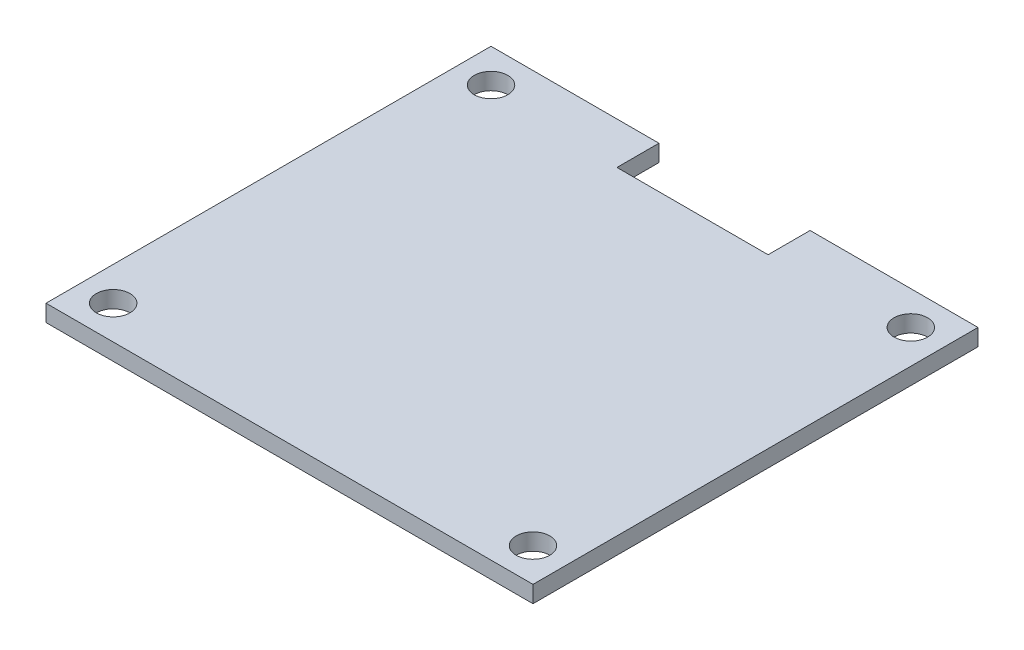
ISO-10303-21;
HEADER;
FILE_DESCRIPTION(('STEP AP214'),'2;1');
FILE_NAME('part.step','',(''),(''),'','','');
FILE_SCHEMA(('AUTOMOTIVE_DESIGN { 1 0 10303 214 1 1 1 1 }'));
ENDSEC;
DATA;
#1=APPLICATION_CONTEXT('core data for automotive mechanical design processes');
#2=APPLICATION_PROTOCOL_DEFINITION('international standard','automotive_design',2000,#1);
#3=PRODUCT_CONTEXT('',#1,'mechanical');
#4=PRODUCT('Part','Part','',(#3));
#5=PRODUCT_RELATED_PRODUCT_CATEGORY('part','',(#4));
#6=PRODUCT_DEFINITION_FORMATION('','',#4);
#7=PRODUCT_DEFINITION_CONTEXT('part definition',#1,'design');
#8=PRODUCT_DEFINITION('design','',#6,#7);
#9=PRODUCT_DEFINITION_SHAPE('','',#8);
#10=(LENGTH_UNIT() NAMED_UNIT(*) SI_UNIT(.MILLI.,.METRE.));
#11=(NAMED_UNIT(*) PLANE_ANGLE_UNIT() SI_UNIT($,.RADIAN.));
#12=(NAMED_UNIT(*) SI_UNIT($,.STERADIAN.) SOLID_ANGLE_UNIT());
#13=UNCERTAINTY_MEASURE_WITH_UNIT(LENGTH_MEASURE(1.E-05),#10,'distance_accuracy_value','');
#14=(GEOMETRIC_REPRESENTATION_CONTEXT(3) GLOBAL_UNCERTAINTY_ASSIGNED_CONTEXT((#13)) GLOBAL_UNIT_ASSIGNED_CONTEXT((#10,
#11,#12)) REPRESENTATION_CONTEXT('',''));
#15=CARTESIAN_POINT('',(0.,0.,0.));
#16=DIRECTION('',(0.,0.,1.));
#17=DIRECTION('',(1.,0.,0.));
#18=AXIS2_PLACEMENT_3D('',#15,#16,#17);
#19=CARTESIAN_POINT('',(-29.,2.,-26.5));
#20=DIRECTION('',(0.,0.,1.));
#21=DIRECTION('',(1.,0.,0.));
#22=AXIS2_PLACEMENT_3D('',#19,#20,#21);
#23=PLANE('',#22);
#24=DIRECTION('',(-1.,0.,0.));
#25=VECTOR('',#24,1.);
#26=CARTESIAN_POINT('',(-29.,2.,-26.5));
#27=LINE('',#26,#25);
#28=CARTESIAN_POINT('',(-9.,2.,-26.5));
#29=VERTEX_POINT('',#28);
#30=CARTESIAN_POINT('',(-29.,2.,-26.5));
#31=VERTEX_POINT('',#30);
#32=EDGE_CURVE('E169',#29,#31,#27,.T.);
#33=ORIENTED_EDGE('',*,*,#32,.F.);
#34=DIRECTION('',(0.,1.,0.));
#35=VECTOR('',#34,1.);
#36=CARTESIAN_POINT('',(-9.,-18.6815416922694,-26.5));
#37=LINE('',#36,#35);
#38=CARTESIAN_POINT('',(-9.,0.,-26.5));
#39=VERTEX_POINT('',#38);
#40=EDGE_CURVE('E126',#39,#29,#37,.T.);
#41=ORIENTED_EDGE('',*,*,#40,.F.);
#42=DIRECTION('',(-1.,0.,0.));
#43=VECTOR('',#42,1.);
#44=CARTESIAN_POINT('',(-29.,0.,-26.5));
#45=LINE('',#44,#43);
#46=CARTESIAN_POINT('',(-29.,0.,-26.5));
#47=VERTEX_POINT('',#46);
#48=EDGE_CURVE('E177',#39,#47,#45,.T.);
#49=ORIENTED_EDGE('',*,*,#48,.T.);
#50=DIRECTION('',(0.,-1.,0.));
#51=VECTOR('',#50,1.);
#52=CARTESIAN_POINT('',(-29.,2.,-26.5));
#53=LINE('',#52,#51);
#54=EDGE_CURVE('E45',#31,#47,#53,.T.);
#55=ORIENTED_EDGE('',*,*,#54,.F.);
#56=EDGE_LOOP('',(#33,#41,#49,#55));
#57=FACE_BOUND('',#56,.T.);
#58=ADVANCED_FACE('F37',(#57),#23,.F.);
#59=CARTESIAN_POINT('',(29.,2.,-26.5));
#60=DIRECTION('',(-1.,0.,0.));
#61=DIRECTION('',(0.,0.,1.));
#62=AXIS2_PLACEMENT_3D('',#59,#60,#61);
#63=PLANE('',#62);
#64=DIRECTION('',(0.,0.,-1.));
#65=VECTOR('',#64,1.);
#66=CARTESIAN_POINT('',(29.,0.,-26.5));
#67=LINE('',#66,#65);
#68=CARTESIAN_POINT('',(29.,0.,26.5));
#69=VERTEX_POINT('',#68);
#70=CARTESIAN_POINT('',(29.,0.,-26.5));
#71=VERTEX_POINT('',#70);
#72=EDGE_CURVE('E166',#69,#71,#67,.T.);
#73=ORIENTED_EDGE('',*,*,#72,.T.);
#74=DIRECTION('',(0.,-1.,0.));
#75=VECTOR('',#74,1.);
#76=CARTESIAN_POINT('',(29.,2.,-26.5));
#77=LINE('',#76,#75);
#78=CARTESIAN_POINT('',(29.,2.,-26.5));
#79=VERTEX_POINT('',#78);
#80=EDGE_CURVE('E11',#79,#71,#77,.T.);
#81=ORIENTED_EDGE('',*,*,#80,.F.);
#82=DIRECTION('',(0.,0.,-1.));
#83=VECTOR('',#82,1.);
#84=CARTESIAN_POINT('',(29.,2.,-26.5));
#85=LINE('',#84,#83);
#86=CARTESIAN_POINT('',(29.,2.,26.5));
#87=VERTEX_POINT('',#86);
#88=EDGE_CURVE('E167',#87,#79,#85,.T.);
#89=ORIENTED_EDGE('',*,*,#88,.F.);
#90=DIRECTION('',(0.,-1.,0.));
#91=VECTOR('',#90,1.);
#92=CARTESIAN_POINT('',(29.,2.,26.5));
#93=LINE('',#92,#91);
#94=EDGE_CURVE('E174',#87,#69,#93,.T.);
#95=ORIENTED_EDGE('',*,*,#94,.T.);
#96=EDGE_LOOP('',(#73,#81,#89,#95));
#97=FACE_BOUND('',#96,.T.);
#98=ADVANCED_FACE('F39',(#97),#63,.F.);
#99=CARTESIAN_POINT('',(9.,0.,-26.5));
#100=VERTEX_POINT('',#99);
#101=EDGE_CURVE('E178',#71,#100,#45,.T.);
#102=ORIENTED_EDGE('',*,*,#101,.T.);
#103=DIRECTION('',(0.,1.,0.));
#104=VECTOR('',#103,1.);
#105=CARTESIAN_POINT('',(9.,-18.6815416922694,-26.5));
#106=LINE('',#105,#104);
#107=CARTESIAN_POINT('',(9.,2.,-26.5));
#108=VERTEX_POINT('',#107);
#109=EDGE_CURVE('E137',#100,#108,#106,.T.);
#110=ORIENTED_EDGE('',*,*,#109,.T.);
#111=EDGE_CURVE('E89',#79,#108,#27,.T.);
#112=ORIENTED_EDGE('',*,*,#111,.F.);
#113=ORIENTED_EDGE('',*,*,#80,.T.);
#114=EDGE_LOOP('',(#102,#110,#112,#113));
#115=FACE_BOUND('',#114,.T.);
#116=ADVANCED_FACE('F212',(#115),#23,.F.);
#117=CARTESIAN_POINT('',(-29.,2.,-26.5));
#118=DIRECTION('',(1.,0.,0.));
#119=DIRECTION('',(0.,0.,-1.));
#120=AXIS2_PLACEMENT_3D('',#117,#118,#119);
#121=PLANE('',#120);
#122=DIRECTION('',(0.,0.,1.));
#123=VECTOR('',#122,1.);
#124=CARTESIAN_POINT('',(-29.,0.,-26.5));
#125=LINE('',#124,#123);
#126=CARTESIAN_POINT('',(-29.,0.,26.5));
#127=VERTEX_POINT('',#126);
#128=EDGE_CURVE('E181',#47,#127,#125,.T.);
#129=ORIENTED_EDGE('',*,*,#128,.T.);
#130=DIRECTION('',(0.,-1.,0.));
#131=VECTOR('',#130,1.);
#132=CARTESIAN_POINT('',(-29.,2.,26.5));
#133=LINE('',#132,#131);
#134=CARTESIAN_POINT('',(-29.,2.,26.5));
#135=VERTEX_POINT('',#134);
#136=EDGE_CURVE('E185',#135,#127,#133,.T.);
#137=ORIENTED_EDGE('',*,*,#136,.F.);
#138=DIRECTION('',(0.,0.,1.));
#139=VECTOR('',#138,1.);
#140=CARTESIAN_POINT('',(-29.,2.,-26.5));
#141=LINE('',#140,#139);
#142=EDGE_CURVE('E171',#31,#135,#141,.T.);
#143=ORIENTED_EDGE('',*,*,#142,.F.);
#144=ORIENTED_EDGE('',*,*,#54,.T.);
#145=EDGE_LOOP('',(#129,#137,#143,#144));
#146=FACE_BOUND('',#145,.T.);
#147=ADVANCED_FACE('F191',(#146),#121,.F.);
#148=CARTESIAN_POINT('',(-29.,2.,26.5));
#149=DIRECTION('',(0.,0.,-1.));
#150=DIRECTION('',(-1.,0.,0.));
#151=AXIS2_PLACEMENT_3D('',#148,#149,#150);
#152=PLANE('',#151);
#153=DIRECTION('',(1.,0.,0.));
#154=VECTOR('',#153,1.);
#155=CARTESIAN_POINT('',(-29.,0.,26.5));
#156=LINE('',#155,#154);
#157=EDGE_CURVE('E82',#127,#69,#156,.T.);
#158=ORIENTED_EDGE('',*,*,#157,.T.);
#159=ORIENTED_EDGE('',*,*,#94,.F.);
#160=DIRECTION('',(1.,0.,0.));
#161=VECTOR('',#160,1.);
#162=CARTESIAN_POINT('',(-29.,2.,26.5));
#163=LINE('',#162,#161);
#164=EDGE_CURVE('E61',#135,#87,#163,.T.);
#165=ORIENTED_EDGE('',*,*,#164,.F.);
#166=ORIENTED_EDGE('',*,*,#136,.T.);
#167=EDGE_LOOP('',(#158,#159,#165,#166));
#168=FACE_BOUND('',#167,.T.);
#169=ADVANCED_FACE('F203',(#168),#152,.F.);
#170=CARTESIAN_POINT('',(0.,2.,0.));
#171=DIRECTION('',(0.,1.,0.));
#172=DIRECTION('',(0.,0.,1.));
#173=AXIS2_PLACEMENT_3D('',#170,#171,#172);
#174=PLANE('',#173);
#175=DIRECTION('',(0.,0.,1.));
#176=VECTOR('',#175,1.);
#177=CARTESIAN_POINT('',(-9.,2.,-26.5));
#178=LINE('',#177,#176);
#179=CARTESIAN_POINT('',(-8.99999999999999,2.,-21.5));
#180=VERTEX_POINT('',#179);
#181=EDGE_CURVE('E123',#29,#180,#178,.T.);
#182=ORIENTED_EDGE('',*,*,#181,.F.);
#183=ORIENTED_EDGE('',*,*,#32,.T.);
#184=ORIENTED_EDGE('',*,*,#142,.T.);
#185=ORIENTED_EDGE('',*,*,#164,.T.);
#186=ORIENTED_EDGE('',*,*,#88,.T.);
#187=ORIENTED_EDGE('',*,*,#111,.T.);
#188=DIRECTION('',(0.,0.,-1.));
#189=VECTOR('',#188,1.);
#190=CARTESIAN_POINT('',(9.,2.,-26.5));
#191=LINE('',#190,#189);
#192=CARTESIAN_POINT('',(9.,2.,-21.5));
#193=VERTEX_POINT('',#192);
#194=EDGE_CURVE('E120',#193,#108,#191,.T.);
#195=ORIENTED_EDGE('',*,*,#194,.F.);
#196=DIRECTION('',(1.,0.,0.));
#197=VECTOR('',#196,1.);
#198=CARTESIAN_POINT('',(-8.99999999999999,2.,-21.5));
#199=LINE('',#198,#197);
#200=EDGE_CURVE('E114',#180,#193,#199,.T.);
#201=ORIENTED_EDGE('',*,*,#200,.F.);
#202=EDGE_LOOP('',(#182,#183,#184,#185,#186,#187,#195,#201));
#203=FACE_BOUND('',#202,.T.);
#204=CARTESIAN_POINT('',(25.,2.,-22.5));
#205=DIRECTION('',(0.,1.,0.));
#206=DIRECTION('',(0.,0.,1.));
#207=AXIS2_PLACEMENT_3D('',#204,#205,#206);
#208=CIRCLE('',#207,2.);
#209=CARTESIAN_POINT('',(25.,2.,-20.5));
#210=VERTEX_POINT('',#209);
#211=EDGE_CURVE('E141',#210,#210,#208,.T.);
#212=ORIENTED_EDGE('',*,*,#211,.F.);
#213=EDGE_LOOP('',(#212));
#214=FACE_BOUND('',#213,.T.);
#215=CARTESIAN_POINT('',(-25.,2.,-22.5));
#216=DIRECTION('',(0.,1.,0.));
#217=DIRECTION('',(0.,0.,1.));
#218=AXIS2_PLACEMENT_3D('',#215,#216,#217);
#219=CIRCLE('',#218,2.);
#220=CARTESIAN_POINT('',(-25.,2.,-20.5));
#221=VERTEX_POINT('',#220);
#222=EDGE_CURVE('E148',#221,#221,#219,.T.);
#223=ORIENTED_EDGE('',*,*,#222,.F.);
#224=EDGE_LOOP('',(#223));
#225=FACE_BOUND('',#224,.T.);
#226=CARTESIAN_POINT('',(-25.,2.,22.5));
#227=DIRECTION('',(0.,1.,0.));
#228=DIRECTION('',(0.,0.,1.));
#229=AXIS2_PLACEMENT_3D('',#226,#227,#228);
#230=CIRCLE('',#229,2.);
#231=CARTESIAN_POINT('',(-25.,2.,24.5));
#232=VERTEX_POINT('',#231);
#233=EDGE_CURVE('E154',#232,#232,#230,.T.);
#234=ORIENTED_EDGE('',*,*,#233,.F.);
#235=EDGE_LOOP('',(#234));
#236=FACE_BOUND('',#235,.T.);
#237=CARTESIAN_POINT('',(25.,2.,22.5));
#238=DIRECTION('',(0.,1.,0.));
#239=DIRECTION('',(0.,0.,1.));
#240=AXIS2_PLACEMENT_3D('',#237,#238,#239);
#241=CIRCLE('',#240,2.);
#242=CARTESIAN_POINT('',(25.,2.,24.5));
#243=VERTEX_POINT('',#242);
#244=EDGE_CURVE('E160',#243,#243,#241,.T.);
#245=ORIENTED_EDGE('',*,*,#244,.F.);
#246=EDGE_LOOP('',(#245));
#247=FACE_BOUND('',#246,.T.);
#248=ADVANCED_FACE('F129',(#203,#214,#225,#236,#247),#174,.T.);
#249=CARTESIAN_POINT('',(0.,0.,0.));
#250=DIRECTION('',(0.,1.,0.));
#251=DIRECTION('',(0.,0.,1.));
#252=AXIS2_PLACEMENT_3D('',#249,#250,#251);
#253=PLANE('',#252);
#254=ORIENTED_EDGE('',*,*,#48,.F.);
#255=DIRECTION('',(0.,0.,-1.));
#256=VECTOR('',#255,1.);
#257=CARTESIAN_POINT('',(-9.,0.,-26.5));
#258=LINE('',#257,#256);
#259=CARTESIAN_POINT('',(-8.99999999999999,0.,-21.5));
#260=VERTEX_POINT('',#259);
#261=EDGE_CURVE('E142',#260,#39,#258,.T.);
#262=ORIENTED_EDGE('',*,*,#261,.F.);
#263=DIRECTION('',(-1.,0.,0.));
#264=VECTOR('',#263,1.);
#265=CARTESIAN_POINT('',(-8.99999999999999,0.,-21.5));
#266=LINE('',#265,#264);
#267=CARTESIAN_POINT('',(9.,0.,-21.5));
#268=VERTEX_POINT('',#267);
#269=EDGE_CURVE('E117',#268,#260,#266,.T.);
#270=ORIENTED_EDGE('',*,*,#269,.F.);
#271=DIRECTION('',(0.,0.,1.));
#272=VECTOR('',#271,1.);
#273=CARTESIAN_POINT('',(9.,0.,-26.5));
#274=LINE('',#273,#272);
#275=EDGE_CURVE('E136',#100,#268,#274,.T.);
#276=ORIENTED_EDGE('',*,*,#275,.F.);
#277=ORIENTED_EDGE('',*,*,#101,.F.);
#278=ORIENTED_EDGE('',*,*,#72,.F.);
#279=ORIENTED_EDGE('',*,*,#157,.F.);
#280=ORIENTED_EDGE('',*,*,#128,.F.);
#281=EDGE_LOOP('',(#254,#262,#270,#276,#277,#278,#279,#280));
#282=FACE_BOUND('',#281,.T.);
#283=CARTESIAN_POINT('',(25.,0.,-22.5));
#284=DIRECTION('',(0.,1.,0.));
#285=DIRECTION('',(0.,0.,1.));
#286=AXIS2_PLACEMENT_3D('',#283,#284,#285);
#287=CIRCLE('',#286,2.);
#288=CARTESIAN_POINT('',(25.,0.,-20.5));
#289=VERTEX_POINT('',#288);
#290=EDGE_CURVE('E145',#289,#289,#287,.T.);
#291=ORIENTED_EDGE('',*,*,#290,.T.);
#292=EDGE_LOOP('',(#291));
#293=FACE_BOUND('',#292,.T.);
#294=CARTESIAN_POINT('',(-25.,0.,-22.5));
#295=DIRECTION('',(0.,1.,0.));
#296=DIRECTION('',(0.,0.,1.));
#297=AXIS2_PLACEMENT_3D('',#294,#295,#296);
#298=CIRCLE('',#297,2.);
#299=CARTESIAN_POINT('',(-25.,0.,-20.5));
#300=VERTEX_POINT('',#299);
#301=EDGE_CURVE('E151',#300,#300,#298,.T.);
#302=ORIENTED_EDGE('',*,*,#301,.T.);
#303=EDGE_LOOP('',(#302));
#304=FACE_BOUND('',#303,.T.);
#305=CARTESIAN_POINT('',(-25.,0.,22.5));
#306=DIRECTION('',(0.,1.,0.));
#307=DIRECTION('',(0.,0.,1.));
#308=AXIS2_PLACEMENT_3D('',#305,#306,#307);
#309=CIRCLE('',#308,2.);
#310=CARTESIAN_POINT('',(-25.,0.,24.5));
#311=VERTEX_POINT('',#310);
#312=EDGE_CURVE('E157',#311,#311,#309,.T.);
#313=ORIENTED_EDGE('',*,*,#312,.T.);
#314=EDGE_LOOP('',(#313));
#315=FACE_BOUND('',#314,.T.);
#316=CARTESIAN_POINT('',(25.,0.,22.5));
#317=DIRECTION('',(0.,1.,0.));
#318=DIRECTION('',(0.,0.,1.));
#319=AXIS2_PLACEMENT_3D('',#316,#317,#318);
#320=CIRCLE('',#319,2.);
#321=CARTESIAN_POINT('',(25.,0.,24.5));
#322=VERTEX_POINT('',#321);
#323=EDGE_CURVE('E163',#322,#322,#320,.T.);
#324=ORIENTED_EDGE('',*,*,#323,.T.);
#325=EDGE_LOOP('',(#324));
#326=FACE_BOUND('',#325,.T.);
#327=ADVANCED_FACE('F196',(#282,#293,#304,#315,#326),#253,.F.);
#328=CARTESIAN_POINT('',(25.,2.,22.5));
#329=DIRECTION('',(0.,1.,0.));
#330=DIRECTION('',(0.,0.,1.));
#331=AXIS2_PLACEMENT_3D('',#328,#329,#330);
#332=CYLINDRICAL_SURFACE('',#331,2.);
#333=ORIENTED_EDGE('',*,*,#323,.F.);
#334=EDGE_LOOP('',(#333));
#335=FACE_BOUND('',#334,.T.);
#336=ORIENTED_EDGE('',*,*,#244,.T.);
#337=EDGE_LOOP('',(#336));
#338=FACE_BOUND('',#337,.T.);
#339=ADVANCED_FACE('F246',(#335,#338),#332,.F.);
#340=CARTESIAN_POINT('',(-25.,2.,22.5));
#341=DIRECTION('',(0.,1.,0.));
#342=DIRECTION('',(0.,0.,1.));
#343=AXIS2_PLACEMENT_3D('',#340,#341,#342);
#344=CYLINDRICAL_SURFACE('',#343,2.);
#345=ORIENTED_EDGE('',*,*,#312,.F.);
#346=EDGE_LOOP('',(#345));
#347=FACE_BOUND('',#346,.T.);
#348=ORIENTED_EDGE('',*,*,#233,.T.);
#349=EDGE_LOOP('',(#348));
#350=FACE_BOUND('',#349,.T.);
#351=ADVANCED_FACE('F242',(#347,#350),#344,.F.);
#352=CARTESIAN_POINT('',(-25.,2.,-22.5));
#353=DIRECTION('',(0.,1.,0.));
#354=DIRECTION('',(0.,0.,1.));
#355=AXIS2_PLACEMENT_3D('',#352,#353,#354);
#356=CYLINDRICAL_SURFACE('',#355,2.);
#357=ORIENTED_EDGE('',*,*,#301,.F.);
#358=EDGE_LOOP('',(#357));
#359=FACE_BOUND('',#358,.T.);
#360=ORIENTED_EDGE('',*,*,#222,.T.);
#361=EDGE_LOOP('',(#360));
#362=FACE_BOUND('',#361,.T.);
#363=ADVANCED_FACE('F238',(#359,#362),#356,.F.);
#364=CARTESIAN_POINT('',(25.,2.,-22.5));
#365=DIRECTION('',(0.,1.,0.));
#366=DIRECTION('',(0.,0.,1.));
#367=AXIS2_PLACEMENT_3D('',#364,#365,#366);
#368=CYLINDRICAL_SURFACE('',#367,2.);
#369=ORIENTED_EDGE('',*,*,#290,.F.);
#370=EDGE_LOOP('',(#369));
#371=FACE_BOUND('',#370,.T.);
#372=ORIENTED_EDGE('',*,*,#211,.T.);
#373=EDGE_LOOP('',(#372));
#374=FACE_BOUND('',#373,.T.);
#375=ADVANCED_FACE('F233',(#371,#374),#368,.F.);
#376=CARTESIAN_POINT('',(-9.,-18.6815416922694,-26.5));
#377=DIRECTION('',(-1.,0.,0.));
#378=DIRECTION('',(0.,0.,1.));
#379=AXIS2_PLACEMENT_3D('',#376,#377,#378);
#380=PLANE('',#379);
#381=ORIENTED_EDGE('',*,*,#261,.T.);
#382=ORIENTED_EDGE('',*,*,#40,.T.);
#383=ORIENTED_EDGE('',*,*,#181,.T.);
#384=DIRECTION('',(0.,1.,0.));
#385=VECTOR('',#384,1.);
#386=CARTESIAN_POINT('',(-8.99999999999999,-18.6815416922694,-21.5));
#387=LINE('',#386,#385);
#388=EDGE_CURVE('E110',#260,#180,#387,.T.);
#389=ORIENTED_EDGE('',*,*,#388,.F.);
#390=EDGE_LOOP('',(#381,#382,#383,#389));
#391=FACE_BOUND('',#390,.T.);
#392=ADVANCED_FACE('F124',(#391),#380,.F.);
#393=CARTESIAN_POINT('',(9.,-18.6815416922694,-26.5));
#394=DIRECTION('',(1.,0.,0.));
#395=DIRECTION('',(0.,0.,-1.));
#396=AXIS2_PLACEMENT_3D('',#393,#394,#395);
#397=PLANE('',#396);
#398=ORIENTED_EDGE('',*,*,#275,.T.);
#399=DIRECTION('',(0.,1.,0.));
#400=VECTOR('',#399,1.);
#401=CARTESIAN_POINT('',(9.,-18.6815416922694,-21.5));
#402=LINE('',#401,#400);
#403=EDGE_CURVE('E52',#268,#193,#402,.T.);
#404=ORIENTED_EDGE('',*,*,#403,.T.);
#405=ORIENTED_EDGE('',*,*,#194,.T.);
#406=ORIENTED_EDGE('',*,*,#109,.F.);
#407=EDGE_LOOP('',(#398,#404,#405,#406));
#408=FACE_BOUND('',#407,.T.);
#409=ADVANCED_FACE('F224',(#408),#397,.F.);
#410=CARTESIAN_POINT('',(-8.99999999999999,-18.6815416922694,-21.5));
#411=DIRECTION('',(0.,0.,1.));
#412=DIRECTION('',(1.,0.,0.));
#413=AXIS2_PLACEMENT_3D('',#410,#411,#412);
#414=PLANE('',#413);
#415=ORIENTED_EDGE('',*,*,#269,.T.);
#416=ORIENTED_EDGE('',*,*,#388,.T.);
#417=ORIENTED_EDGE('',*,*,#200,.T.);
#418=ORIENTED_EDGE('',*,*,#403,.F.);
#419=EDGE_LOOP('',(#415,#416,#417,#418));
#420=FACE_BOUND('',#419,.T.);
#421=ADVANCED_FACE('F112',(#420),#414,.F.);
#422=CLOSED_SHELL('',(#58,#98,#116,#147,#169,#248,#327,#339,#351,#363,#375,#392,#409,#421));
#423=MANIFOLD_SOLID_BREP('B2',#422);
#424=ADVANCED_BREP_SHAPE_REPRESENTATION('',(#18,#423),#14);
#425=SHAPE_DEFINITION_REPRESENTATION(#9,#424);
ENDSEC;
END-ISO-10303-21;
